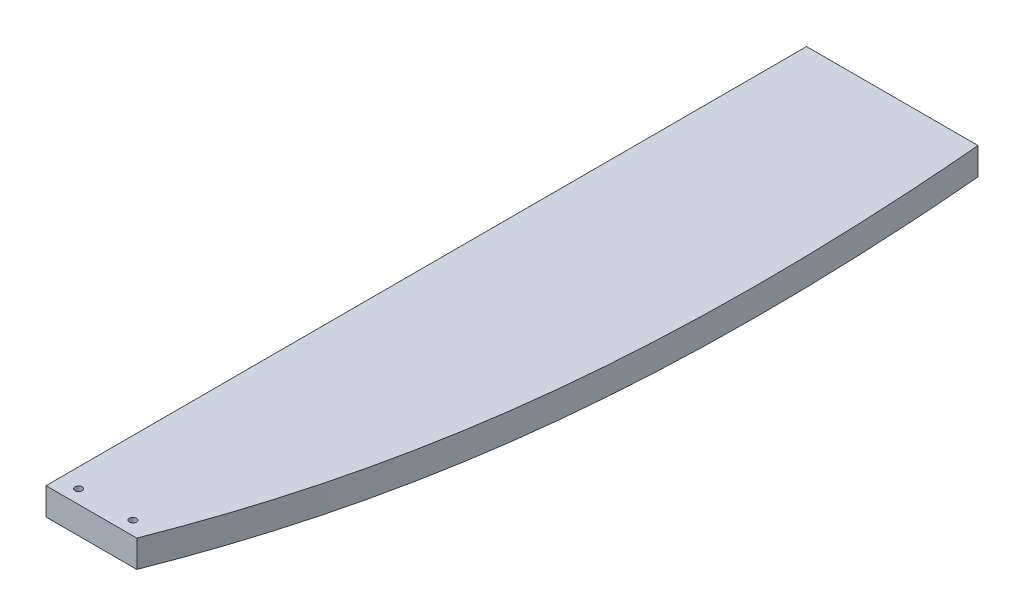
ISO-10303-21;
HEADER;
FILE_DESCRIPTION(('STEP AP214'),'2;1');
FILE_NAME('part.step','',(''),(''),'','','');
FILE_SCHEMA(('AUTOMOTIVE_DESIGN { 1 0 10303 214 1 1 1 1 }'));
ENDSEC;
DATA;
#1=APPLICATION_CONTEXT('core data for automotive mechanical design processes');
#2=APPLICATION_PROTOCOL_DEFINITION('international standard','automotive_design',2000,#1);
#3=PRODUCT_CONTEXT('',#1,'mechanical');
#4=PRODUCT('Part','Part','',(#3));
#5=PRODUCT_RELATED_PRODUCT_CATEGORY('part','',(#4));
#6=PRODUCT_DEFINITION_FORMATION('','',#4);
#7=PRODUCT_DEFINITION_CONTEXT('part definition',#1,'design');
#8=PRODUCT_DEFINITION('design','',#6,#7);
#9=PRODUCT_DEFINITION_SHAPE('','',#8);
#10=(LENGTH_UNIT() NAMED_UNIT(*) SI_UNIT(.MILLI.,.METRE.));
#11=(NAMED_UNIT(*) PLANE_ANGLE_UNIT() SI_UNIT($,.RADIAN.));
#12=(NAMED_UNIT(*) SI_UNIT($,.STERADIAN.) SOLID_ANGLE_UNIT());
#13=UNCERTAINTY_MEASURE_WITH_UNIT(LENGTH_MEASURE(1.E-05),#10,'distance_accuracy_value','');
#14=(GEOMETRIC_REPRESENTATION_CONTEXT(3) GLOBAL_UNCERTAINTY_ASSIGNED_CONTEXT((#13)) GLOBAL_UNIT_ASSIGNED_CONTEXT((#10,
#11,#12)) REPRESENTATION_CONTEXT('',''));
#15=CARTESIAN_POINT('',(0.,0.,0.));
#16=DIRECTION('',(0.,0.,1.));
#17=DIRECTION('',(1.,0.,0.));
#18=AXIS2_PLACEMENT_3D('',#15,#16,#17);
#19=CARTESIAN_POINT('',(389.5016067869,5194.3,2950.05622050594));
#20=DIRECTION('',(0.,1.,0.));
#21=DIRECTION('',(-1.,0.,0.));
#22=AXIS2_PLACEMENT_3D('',#19,#20,#21);
#23=PLANE('',#22);
#24=CARTESIAN_POINT('',(376.528681754766,5194.30000000001,3207.07744091049));
#25=DIRECTION('',(0.,1.,0.));
#26=DIRECTION('',(-1.,0.,0.));
#27=AXIS2_PLACEMENT_3D('',#24,#25,#26);
#28=CIRCLE('',#27,2.45744999999997);
#29=CARTESIAN_POINT('',(374.071231754766,5194.30000000001,3207.07744091049));
#30=VERTEX_POINT('',#29);
#31=EDGE_CURVE('E310',#30,#30,#28,.T.);
#32=ORIENTED_EDGE('',*,*,#31,.T.);
#33=EDGE_LOOP('',(#32));
#34=FACE_BOUND('',#33,.T.);
#35=CARTESIAN_POINT('',(338.428578956983,5194.3,3207.07744091058));
#36=DIRECTION('',(0.,1.,0.));
#37=DIRECTION('',(-1.,0.,0.));
#38=AXIS2_PLACEMENT_3D('',#35,#36,#37);
#39=CIRCLE('',#38,2.45744999999997);
#40=CARTESIAN_POINT('',(335.971128956983,5194.3,3207.07744091058));
#41=VERTEX_POINT('',#40);
#42=EDGE_CURVE('E136',#41,#41,#39,.T.);
#43=ORIENTED_EDGE('',*,*,#42,.T.);
#44=EDGE_LOOP('',(#43));
#45=FACE_BOUND('',#44,.T.);
#46=DIRECTION('',(-1.,0.,0.));
#47=VECTOR('',#46,1.);
#48=CARTESIAN_POINT('',(445.271141729743,5194.3,2683.51));
#49=LINE('',#48,#47);
#50=CARTESIAN_POINT('',(445.271141729743,5194.3,2683.51));
#51=VERTEX_POINT('',#50);
#52=CARTESIAN_POINT('',(325.120000000001,5194.3,2683.51));
#53=VERTEX_POINT('',#52);
#54=EDGE_CURVE('E178',#51,#53,#49,.T.);
#55=ORIENTED_EDGE('',*,*,#54,.F.);
#56=CARTESIAN_POINT('',(388.748833209512,5194.3,3216.60244101189));
#57=CARTESIAN_POINT('',(389.522252968135,5194.30000000001,3214.63182176014));
#58=CARTESIAN_POINT('',(390.288721724351,5194.30000000001,3212.65847358438));
#59=CARTESIAN_POINT('',(391.807587176833,5194.30000000001,3208.70646110342));
#60=CARTESIAN_POINT('',(392.559984442725,5194.30000000001,3206.72779701715));
#61=CARTESIAN_POINT('',(394.050584006539,5194.30000000001,3202.7651760804));
#62=CARTESIAN_POINT('',(394.788786601799,5194.30000000001,3200.78121934178));
#63=CARTESIAN_POINT('',(396.251182478673,5194.30000000001,3196.8072370958));
#64=CARTESIAN_POINT('',(396.975369962836,5194.30000000001,3194.81720945522));
#65=CARTESIAN_POINT('',(398.409326379546,5194.30000000001,3190.8319153354));
#66=CARTESIAN_POINT('',(399.119095003552,5194.30000000001,3188.83664874507));
#67=CARTESIAN_POINT('',(400.524120705958,5194.30000000001,3184.84092335103));
#68=CARTESIAN_POINT('',(401.219377144054,5194.3,3182.84046432257));
#69=CARTESIAN_POINT('',(403.979981150923,5194.3,3174.80275179745));
#70=CARTESIAN_POINT('',(405.986229361712,5194.30000000001,3168.7450562538));
#71=CARTESIAN_POINT('',(409.864016063093,5194.30000000001,3156.58584521959));
#72=CARTESIAN_POINT('',(411.735535675616,5194.30000000001,3150.48432371939));
#73=CARTESIAN_POINT('',(415.342670234218,5194.30000000001,3138.24071743662));
#74=CARTESIAN_POINT('',(417.07827486598,5194.30000000001,3132.09862961383));
#75=CARTESIAN_POINT('',(420.413307310402,5194.30000000001,3119.77755039309));
#76=CARTESIAN_POINT('',(422.012733917512,5194.30000000001,3113.59855866895));
#77=CARTESIAN_POINT('',(425.076507654873,5194.30000000001,3101.20582036093));
#78=CARTESIAN_POINT('',(426.540826480793,5194.30000000001,3094.99206678251));
#79=CARTESIAN_POINT('',(429.335602965529,5194.30000000001,3082.53477442042));
#80=CARTESIAN_POINT('',(430.66606528599,5194.30000000001,3076.29123668194));
#81=CARTESIAN_POINT('',(433.195551254199,5194.30000000001,3063.77787947901));
#82=CARTESIAN_POINT('',(434.394580050257,5194.30000000001,3057.50806105398));
#83=CARTESIAN_POINT('',(436.664262798693,5194.30000000001,3044.94572418597));
#84=CARTESIAN_POINT('',(437.734926596352,5194.3,3038.65320752207));
#85=CARTESIAN_POINT('',(439.412841289308,5194.3,3028.16585891989));
#86=CARTESIAN_POINT('',(440.054930598952,5194.30000000001,3023.97656044392));
#87=CARTESIAN_POINT('',(441.285326649013,5194.30000000001,3015.59028760335));
#88=CARTESIAN_POINT('',(441.873636207082,5194.30000000001,3011.39331365267));
#89=CARTESIAN_POINT('',(442.997751229944,5194.30000000001,3002.99243079538));
#90=CARTESIAN_POINT('',(443.533557687156,5194.30000000001,2998.7885220214));
#91=CARTESIAN_POINT('',(444.553830346815,5194.30000000001,2990.37588429152));
#92=CARTESIAN_POINT('',(445.038313336258,5194.30000000001,2986.16715736967));
#93=CARTESIAN_POINT('',(445.957511897611,5194.30000000001,2977.74420167879));
#94=CARTESIAN_POINT('',(446.39222661266,5194.30000000001,2973.5299728163));
#95=CARTESIAN_POINT('',(447.213286250907,5194.30000000001,2965.0967391719));
#96=CARTESIAN_POINT('',(447.599630208292,5194.3,2960.87773429633));
#97=CARTESIAN_POINT('',(448.610399554395,5194.3,2949.12002029531));
#98=CARTESIAN_POINT('',(449.183460079724,5194.30000000001,2941.57684955928));
#99=CARTESIAN_POINT('',(450.188110587309,5194.30000000001,2926.48082596249));
#100=CARTESIAN_POINT('',(450.619694361841,5194.30000000001,2918.92797269146));
#101=CARTESIAN_POINT('',(451.167099565233,5194.30000000001,2907.5939338846));
#102=CARTESIAN_POINT('',(451.332907313246,5194.30000000001,2903.81509221511));
#103=CARTESIAN_POINT('',(451.63220063042,5194.30000000001,2896.2561191346));
#104=CARTESIAN_POINT('',(451.765686187029,5194.30000000001,2892.47598772308));
#105=CARTESIAN_POINT('',(452.001447257516,5194.30000000001,2884.91259385326));
#106=CARTESIAN_POINT('',(452.103704889073,5194.30000000001,2881.12933084029));
#107=CARTESIAN_POINT('',(452.277368935587,5194.30000000001,2873.56209999784));
#108=CARTESIAN_POINT('',(452.34877536084,5194.30000000001,2869.77813216859));
#109=CARTESIAN_POINT('',(452.462007398327,5194.30000000001,2862.20982426264));
#110=CARTESIAN_POINT('',(452.503833548247,5194.30000000001,2858.42548419396));
#111=CARTESIAN_POINT('',(452.558952189986,5194.30000000001,2850.8566043691));
#112=CARTESIAN_POINT('',(452.572244665884,5194.30000000001,2847.07206461283));
#113=CARTESIAN_POINT('',(452.570825815498,5194.30000000001,2835.71848246225));
#114=CARTESIAN_POINT('',(452.514819254081,5194.3,2828.14940488104));
#115=CARTESIAN_POINT('',(452.325706518358,5194.3,2814.8576360439));
#116=CARTESIAN_POINT('',(452.214721414391,5194.30000000001,2809.13460593405));
#117=CARTESIAN_POINT('',(451.936070151198,5194.30000000001,2797.68993762865));
#118=CARTESIAN_POINT('',(451.768404183398,5194.30000000001,2791.96829942846));
#119=CARTESIAN_POINT('',(451.378470854026,5194.30000000001,2780.52685123598));
#120=CARTESIAN_POINT('',(451.156203086376,5194.30000000001,2774.80704125759));
#121=CARTESIAN_POINT('',(450.658785505363,5194.30000000001,2763.36967450208));
#122=CARTESIAN_POINT('',(450.383635226402,5194.30000000001,2757.65211774522));
#123=CARTESIAN_POINT('',(449.782227506016,5194.30000000001,2746.22711571753));
#124=CARTESIAN_POINT('',(449.456036663212,5194.30000000001,2740.51966693659));
#125=CARTESIAN_POINT('',(448.753336873391,5194.30000000001,2729.10791697049));
#126=CARTESIAN_POINT('',(448.376828318642,5194.30000000001,2723.40361576115));
#127=CARTESIAN_POINT('',(447.57420189739,5194.30000000001,2711.99864715379));
#128=CARTESIAN_POINT('',(447.148085321016,5194.30000000001,2706.29797966515));
#129=CARTESIAN_POINT('',(446.471952170237,5194.30000000001,2697.75005038914));
#130=CARTESIAN_POINT('',(446.240420243813,5194.30000000001,2694.9013153148));
#131=CARTESIAN_POINT('',(445.765028486666,5194.30000000001,2689.20487423171));
#132=CARTESIAN_POINT('',(445.52116865699,5194.3,2686.35716822288));
#133=CARTESIAN_POINT('',(445.271141729745,5194.3,2683.51));
#134=B_SPLINE_CURVE_WITH_KNOTS('',3,(#56,#57,#58,#59,#60,#61,#62,#63,#64,#65,#66,#67,#68,#69,
#70,#71,#72,#73,#74,#75,#76,#77,#78,#79,#80,#81,#82,#83,#84,#85,#86,#87,#88,#89,#90,#91,#92,#93,
#94,#95,#96,#97,#98,#99,#100,#101,#102,#103,#104,#105,#106,#107,#108,#109,#110,#111,#112,#113,
#114,#115,#116,#117,#118,#119,#120,#121,#122,#123,#124,#125,#126,#127,#128,#129,#130,#131,#132,
#133),.UNSPECIFIED.,.F.,.F.,(4,2,2,2,2,2,2,2,2,2,2,2,2,2,2,2,2,2,2,2,2,2,2,2,2,2,2,2,2,2,2,2,2,
2,2,2,2,2,4),(0.,6.3508670135695,12.7014763794555,19.0519525736826,25.4050018387989,
31.7581869055696,38.1116516963101,57.2537350240531,76.3984953265155,95.5447070815522,
114.691088315576,133.841471545987,152.99118762006,172.140153323164,191.287649407017,
204.001986076296,216.715656228674,229.429086019741,242.13834455025,254.847821863679,
267.557552904961,290.250765480576,312.944973656978,324.292291318836,335.639613387369,
346.993421240415,358.347225304225,369.700822982526,381.05442699613,403.761418106076,
420.933479573432,438.105483047311,455.277614235264,472.449896620545,489.599956338763,
506.7498823654,523.899362482219,532.473724957064,541.048086704672),.UNSPECIFIED.);
#135=CARTESIAN_POINT('',(388.748833209511,5194.30000000001,3216.60244101189));
#136=VERTEX_POINT('',#135);
#137=EDGE_CURVE('E86',#136,#51,#134,.T.);
#138=ORIENTED_EDGE('',*,*,#137,.F.);
#139=DIRECTION('',(1.,0.,0.));
#140=VECTOR('',#139,1.);
#141=CARTESIAN_POINT('',(325.120000000002,5194.3,3216.60244101189));
#142=LINE('',#141,#140);
#143=CARTESIAN_POINT('',(325.120000000002,5194.3,3216.60244101189));
#144=VERTEX_POINT('',#143);
#145=EDGE_CURVE('E92',#144,#136,#142,.T.);
#146=ORIENTED_EDGE('',*,*,#145,.F.);
#147=DIRECTION('',(0.,0.,1.));
#148=VECTOR('',#147,1.);
#149=CARTESIAN_POINT('',(325.120000000001,5194.3,2683.51));
#150=LINE('',#149,#148);
#151=EDGE_CURVE('E100',#53,#144,#150,.T.);
#152=ORIENTED_EDGE('',*,*,#151,.F.);
#153=EDGE_LOOP('',(#55,#138,#146,#152));
#154=FACE_BOUND('',#153,.T.);
#155=ADVANCED_FACE('F52',(#34,#45,#154),#23,.F.);
#156=CARTESIAN_POINT('',(325.120000000001,5194.3,2683.51));
#157=DIRECTION('',(-1.,0.,0.));
#158=DIRECTION('',(0.,-1.,0.));
#159=AXIS2_PLACEMENT_3D('',#156,#157,#158);
#160=PLANE('',#159);
#161=CARTESIAN_POINT('',(325.12,5203.82500000001,2785.11));
#162=DIRECTION('',(-1.,0.,0.));
#163=DIRECTION('',(0.,-1.,0.));
#164=AXIS2_PLACEMENT_3D('',#161,#162,#163);
#165=CIRCLE('',#164,0.991870000000006);
#166=CARTESIAN_POINT('',(325.12,5202.83313000001,2785.11));
#167=VERTEX_POINT('',#166);
#168=EDGE_CURVE('E59',#167,#167,#165,.T.);
#169=ORIENTED_EDGE('',*,*,#168,.F.);
#170=EDGE_LOOP('',(#169));
#171=FACE_BOUND('',#170,.T.);
#172=CARTESIAN_POINT('',(325.12,5203.825,2886.71));
#173=DIRECTION('',(-1.,0.,0.));
#174=DIRECTION('',(0.,-1.,0.));
#175=AXIS2_PLACEMENT_3D('',#172,#173,#174);
#176=CIRCLE('',#175,0.991870000000006);
#177=CARTESIAN_POINT('',(325.12,5202.83313,2886.71));
#178=VERTEX_POINT('',#177);
#179=EDGE_CURVE('E147',#178,#178,#176,.T.);
#180=ORIENTED_EDGE('',*,*,#179,.F.);
#181=EDGE_LOOP('',(#180));
#182=FACE_BOUND('',#181,.T.);
#183=CARTESIAN_POINT('',(325.12,5203.825,2988.31));
#184=DIRECTION('',(-1.,0.,0.));
#185=DIRECTION('',(0.,-1.,0.));
#186=AXIS2_PLACEMENT_3D('',#183,#184,#185);
#187=CIRCLE('',#186,0.991870000000006);
#188=CARTESIAN_POINT('',(325.12,5202.83313,2988.31));
#189=VERTEX_POINT('',#188);
#190=EDGE_CURVE('E151',#189,#189,#187,.T.);
#191=ORIENTED_EDGE('',*,*,#190,.F.);
#192=EDGE_LOOP('',(#191));
#193=FACE_BOUND('',#192,.T.);
#194=CARTESIAN_POINT('',(325.12,5203.82500000001,3089.91));
#195=DIRECTION('',(-1.,0.,0.));
#196=DIRECTION('',(0.,-1.,0.));
#197=AXIS2_PLACEMENT_3D('',#194,#195,#196);
#198=CIRCLE('',#197,0.991870000000006);
#199=CARTESIAN_POINT('',(325.12,5202.83313000001,3089.91));
#200=VERTEX_POINT('',#199);
#201=EDGE_CURVE('E155',#200,#200,#198,.T.);
#202=ORIENTED_EDGE('',*,*,#201,.F.);
#203=EDGE_LOOP('',(#202));
#204=FACE_BOUND('',#203,.T.);
#205=CARTESIAN_POINT('',(325.12,5203.825,3191.51));
#206=DIRECTION('',(-1.,0.,0.));
#207=DIRECTION('',(0.,-1.,0.));
#208=AXIS2_PLACEMENT_3D('',#205,#206,#207);
#209=CIRCLE('',#208,0.991870000000006);
#210=CARTESIAN_POINT('',(325.12,5202.83313,3191.51));
#211=VERTEX_POINT('',#210);
#212=EDGE_CURVE('E159',#211,#211,#209,.T.);
#213=ORIENTED_EDGE('',*,*,#212,.F.);
#214=EDGE_LOOP('',(#213));
#215=FACE_BOUND('',#214,.T.);
#216=DIRECTION('',(0.,0.,1.));
#217=VECTOR('',#216,1.);
#218=CARTESIAN_POINT('',(325.120000000001,5213.35,2950.05622050594));
#219=LINE('',#218,#217);
#220=CARTESIAN_POINT('',(325.12,5213.35,2683.51));
#221=VERTEX_POINT('',#220);
#222=CARTESIAN_POINT('',(325.12,5213.35,3216.6024410119));
#223=VERTEX_POINT('',#222);
#224=EDGE_CURVE('E106',#221,#223,#219,.T.);
#225=ORIENTED_EDGE('',*,*,#224,.F.);
#226=DIRECTION('',(0.,1.,0.));
#227=VECTOR('',#226,1.);
#228=CARTESIAN_POINT('',(325.120000000001,5194.3,2683.51));
#229=LINE('',#228,#227);
#230=EDGE_CURVE('E176',#53,#221,#229,.T.);
#231=ORIENTED_EDGE('',*,*,#230,.F.);
#232=ORIENTED_EDGE('',*,*,#151,.T.);
#233=DIRECTION('',(0.,1.,0.));
#234=VECTOR('',#233,1.);
#235=CARTESIAN_POINT('',(325.120000000002,5194.3,3216.60244101189));
#236=LINE('',#235,#234);
#237=EDGE_CURVE('E187',#223,#144,#236,.F.);
#238=ORIENTED_EDGE('',*,*,#237,.F.);
#239=EDGE_LOOP('',(#225,#231,#232,#238));
#240=FACE_BOUND('',#239,.T.);
#241=ADVANCED_FACE('F229',(#171,#182,#193,#204,#215,#240),#160,.T.);
#242=CARTESIAN_POINT('',(325.120000000002,5194.3,3216.60244101189));
#243=DIRECTION('',(0.,0.,1.));
#244=DIRECTION('',(1.,0.,0.));
#245=AXIS2_PLACEMENT_3D('',#242,#243,#244);
#246=PLANE('',#245);
#247=DIRECTION('',(-1.,0.,0.));
#248=VECTOR('',#247,1.);
#249=CARTESIAN_POINT('',(389.501606786901,5213.35000000001,3216.60244101189));
#250=LINE('',#249,#248);
#251=CARTESIAN_POINT('',(388.748833209509,5213.35,3216.60244101189));
#252=VERTEX_POINT('',#251);
#253=EDGE_CURVE('E170',#223,#252,#250,.F.);
#254=ORIENTED_EDGE('',*,*,#253,.F.);
#255=ORIENTED_EDGE('',*,*,#237,.T.);
#256=ORIENTED_EDGE('',*,*,#145,.T.);
#257=DIRECTION('',(1.36890498936282E-13,-1.,0.));
#258=VECTOR('',#257,1.);
#259=CARTESIAN_POINT('',(388.74883320951,5203.825,3216.6024410119));
#260=LINE('',#259,#258);
#261=EDGE_CURVE('E184',#252,#136,#260,.T.);
#262=ORIENTED_EDGE('',*,*,#261,.F.);
#263=EDGE_LOOP('',(#254,#255,#256,#262));
#264=FACE_BOUND('',#263,.T.);
#265=ADVANCED_FACE('F226',(#264),#246,.T.);
#266=CARTESIAN_POINT('',(388.748833209512,5194.3,3216.60244101189));
#267=CARTESIAN_POINT('',(388.748833209509,5213.35,3216.60244101189));
#268=CARTESIAN_POINT('',(427.328274562891,5194.30000000001,3118.30445867765));
#269=CARTESIAN_POINT('',(427.328274562891,5213.35000000001,3118.30445867765));
#270=CARTESIAN_POINT('',(448.538626648827,5194.3,3013.430965814));
#271=CARTESIAN_POINT('',(448.538626648827,5213.35000000001,3013.430965814));
#272=CARTESIAN_POINT('',(453.875260666032,5194.30000000001,2815.15896694759));
#273=CARTESIAN_POINT('',(453.875260666028,5213.35,2815.15896694759));
#274=CARTESIAN_POINT('',(450.72161494878,5194.3,2745.57602142326));
#275=CARTESIAN_POINT('',(450.721614948777,5213.35,2745.57602142326));
#276=CARTESIAN_POINT('',(445.271141729743,5194.3,2683.51));
#277=CARTESIAN_POINT('',(445.271141729743,5213.35000000001,2683.51));
#278=B_SPLINE_SURFACE_WITH_KNOTS('',3,1,((#266,#267),(#268,#269),(#270,#271),(#272,#273),(#274,
#275),(#276,#277)),.UNSPECIFIED.,.F.,.F.,.F.,(4,2,4),(2,2),(-53.1349686655124,-24.0856941468216,
-9.03456928373366),(0.,1.90499999999997),.UNSPECIFIED.);
#279=CARTESIAN_POINT('',(388.748833209509,5213.35,3216.60244101189));
#280=CARTESIAN_POINT('',(389.522252968131,5213.35000000001,3214.63182176014));
#281=CARTESIAN_POINT('',(390.288721724348,5213.35000000001,3212.65847358438));
#282=CARTESIAN_POINT('',(391.80758717683,5213.35000000001,3208.70646110342));
#283=CARTESIAN_POINT('',(392.559984442722,5213.35000000001,3206.72779701715));
#284=CARTESIAN_POINT('',(394.050584006537,5213.35000000001,3202.7651760804));
#285=CARTESIAN_POINT('',(394.788786601796,5213.35000000001,3200.78121934178));
#286=CARTESIAN_POINT('',(396.251182478669,5213.35000000001,3196.80723709581));
#287=CARTESIAN_POINT('',(396.975369962834,5213.35000000001,3194.81720945522));
#288=CARTESIAN_POINT('',(398.409326379543,5213.35000000001,3190.8319153354));
#289=CARTESIAN_POINT('',(399.119095003549,5213.35000000001,3188.83664874507));
#290=CARTESIAN_POINT('',(400.524120705956,5213.35000000001,3184.84092335103));
#291=CARTESIAN_POINT('',(401.219377144053,5213.35,3182.84046432257));
#292=CARTESIAN_POINT('',(403.979981150924,5213.35,3174.80275179745));
#293=CARTESIAN_POINT('',(405.986229361711,5213.35000000001,3168.7450562538));
#294=CARTESIAN_POINT('',(409.864016063091,5213.35000000001,3156.58584521959));
#295=CARTESIAN_POINT('',(411.735535675614,5213.35000000001,3150.48432371939));
#296=CARTESIAN_POINT('',(415.342670234216,5213.35000000001,3138.24071743662));
#297=CARTESIAN_POINT('',(417.078274865978,5213.35000000001,3132.09862961383));
#298=CARTESIAN_POINT('',(420.413307310401,5213.35000000001,3119.77755039309));
#299=CARTESIAN_POINT('',(422.012733917511,5213.35000000001,3113.59855866895));
#300=CARTESIAN_POINT('',(425.076507654872,5213.35000000001,3101.20582036093));
#301=CARTESIAN_POINT('',(426.540826480792,5213.35000000001,3094.99206678251));
#302=CARTESIAN_POINT('',(429.335602965528,5213.35000000001,3082.53477442042));
#303=CARTESIAN_POINT('',(430.666065285989,5213.35000000001,3076.29123668194));
#304=CARTESIAN_POINT('',(433.195551254199,5213.35000000001,3063.77787947901));
#305=CARTESIAN_POINT('',(434.394580050256,5213.35000000001,3057.50806105398));
#306=CARTESIAN_POINT('',(436.664262798693,5213.35000000001,3044.94572418597));
#307=CARTESIAN_POINT('',(437.734926596351,5213.35,3038.65320752207));
#308=CARTESIAN_POINT('',(439.412841289307,5213.35,3028.16585891989));
#309=CARTESIAN_POINT('',(440.054930598951,5213.35000000001,3023.97656044392));
#310=CARTESIAN_POINT('',(441.285326649012,5213.35000000001,3015.59028760335));
#311=CARTESIAN_POINT('',(441.87363620708,5213.35000000001,3011.39331365267));
#312=CARTESIAN_POINT('',(442.997751229943,5213.35000000001,3002.99243079538));
#313=CARTESIAN_POINT('',(443.533557687155,5213.35000000001,2998.7885220214));
#314=CARTESIAN_POINT('',(444.553830346814,5213.35000000001,2990.37588429152));
#315=CARTESIAN_POINT('',(445.038313336256,5213.35000000001,2986.16715736967));
#316=CARTESIAN_POINT('',(445.95751189761,5213.35000000001,2977.7442016788));
#317=CARTESIAN_POINT('',(446.392226612659,5213.35000000001,2973.5299728163));
#318=CARTESIAN_POINT('',(447.213286250906,5213.35000000001,2965.0967391719));
#319=CARTESIAN_POINT('',(447.599630208291,5213.35000000001,2960.87773429634));
#320=CARTESIAN_POINT('',(448.610399554394,5213.35,2949.12002029531));
#321=CARTESIAN_POINT('',(449.183460079722,5213.35000000001,2941.57684955929));
#322=CARTESIAN_POINT('',(450.188110587307,5213.35000000001,2926.48082596249));
#323=CARTESIAN_POINT('',(450.619694361839,5213.35000000001,2918.92797269146));
#324=CARTESIAN_POINT('',(451.167099565231,5213.35000000001,2907.5939338846));
#325=CARTESIAN_POINT('',(451.332907313243,5213.35000000001,2903.81509221511));
#326=CARTESIAN_POINT('',(451.632200630417,5213.35000000001,2896.2561191346));
#327=CARTESIAN_POINT('',(451.765686187027,5213.35000000001,2892.47598772308));
#328=CARTESIAN_POINT('',(452.001447257514,5213.35000000001,2884.91259385326));
#329=CARTESIAN_POINT('',(452.10370488907,5213.35000000001,2881.12933084029));
#330=CARTESIAN_POINT('',(452.277368935584,5213.35000000001,2873.56209999784));
#331=CARTESIAN_POINT('',(452.348775360837,5213.35000000001,2869.77813216859));
#332=CARTESIAN_POINT('',(452.462007398324,5213.35000000001,2862.20982426264));
#333=CARTESIAN_POINT('',(452.503833548244,5213.35000000001,2858.42548419396));
#334=CARTESIAN_POINT('',(452.558952189983,5213.35000000001,2850.85660436911));
#335=CARTESIAN_POINT('',(452.572244665881,5213.35000000001,2847.07206461283));
#336=CARTESIAN_POINT('',(452.570825815495,5213.35000000001,2835.71848246225));
#337=CARTESIAN_POINT('',(452.514819254078,5213.35,2828.14940488104));
#338=CARTESIAN_POINT('',(452.325706518355,5213.35,2814.8576360439));
#339=CARTESIAN_POINT('',(452.214721414388,5213.35000000001,2809.13460593405));
#340=CARTESIAN_POINT('',(451.936070151195,5213.35000000001,2797.68993762865));
#341=CARTESIAN_POINT('',(451.768404183395,5213.35000000001,2791.96829942846));
#342=CARTESIAN_POINT('',(451.378470854023,5213.35000000001,2780.52685123598));
#343=CARTESIAN_POINT('',(451.156203086373,5213.35000000001,2774.80704125759));
#344=CARTESIAN_POINT('',(450.65878550536,5213.35000000001,2763.36967450208));
#345=CARTESIAN_POINT('',(450.383635226399,5213.35000000001,2757.65211774522));
#346=CARTESIAN_POINT('',(449.782227506013,5213.35000000001,2746.22711571754));
#347=CARTESIAN_POINT('',(449.456036663209,5213.35000000001,2740.51966693659));
#348=CARTESIAN_POINT('',(448.753336873388,5213.35000000001,2729.10791697049));
#349=CARTESIAN_POINT('',(448.37682831864,5213.35000000001,2723.40361576115));
#350=CARTESIAN_POINT('',(447.574201897388,5213.35000000001,2711.99864715379));
#351=CARTESIAN_POINT('',(447.148085321015,5213.35000000001,2706.29797966515));
#352=CARTESIAN_POINT('',(446.471952170236,5213.35000000001,2697.75005038914));
#353=CARTESIAN_POINT('',(446.240420243812,5213.35000000001,2694.9013153148));
#354=CARTESIAN_POINT('',(445.765028486665,5213.35000000001,2689.20487423171));
#355=CARTESIAN_POINT('',(445.521168656988,5213.35000000001,2686.35716822288));
#356=CARTESIAN_POINT('',(445.271141729743,5213.35,2683.51));
#357=B_SPLINE_CURVE_WITH_KNOTS('',3,(#279,#280,#281,#282,#283,#284,#285,#286,#287,#288,#289,
#290,#291,#292,#293,#294,#295,#296,#297,#298,#299,#300,#301,#302,#303,#304,#305,#306,#307,#308,
#309,#310,#311,#312,#313,#314,#315,#316,#317,#318,#319,#320,#321,#322,#323,#324,#325,#326,#327,
#328,#329,#330,#331,#332,#333,#334,#335,#336,#337,#338,#339,#340,#341,#342,#343,#344,#345,#346,
#347,#348,#349,#350,#351,#352,#353,#354,#355,#356),.UNSPECIFIED.,.F.,.F.,(4,2,2,2,2,2,2,2,2,2,2,
2,2,2,2,2,2,2,2,2,2,2,2,2,2,2,2,2,2,2,2,2,2,2,2,2,2,2,4),(0.,6.35086701356911,12.7014763794556,
19.0519525736827,25.4050018387991,31.7581869055703,38.1116516963113,57.2537350240541,
76.398495326516,95.5447070815528,114.691088315577,133.841471545988,152.991187620062,
172.140153323166,191.287649407018,204.001986076297,216.715656228675,229.429086019741,
242.138344550251,254.847821863679,267.55755290496,290.250765480575,312.944973656978,
324.292291318835,335.639613387369,346.993421240414,358.347225304225,369.700822982527,
381.054426996129,403.761418106076,420.933479573433,438.105483047311,455.277614235264,
472.449896620545,489.599956338764,506.7498823654,523.899362482219,532.473724957065,
541.048086704672),.UNSPECIFIED.);
#358=CARTESIAN_POINT('',(445.271141729744,5213.35000000001,2683.51));
#359=VERTEX_POINT('',#358);
#360=EDGE_CURVE('E65',#252,#359,#357,.T.);
#361=DIRECTION('',(0.,1.,0.));
#362=VECTOR('',#361,1.);
#363=CARTESIAN_POINT('',(445.271141729743,5194.3,2683.51));
#364=LINE('',#363,#362);
#365=EDGE_CURVE('E74',#359,#51,#364,.F.);
#366=ORIENTED_EDGE('',*,*,#360,.F.);
#367=ORIENTED_EDGE('',*,*,#261,.T.);
#368=ORIENTED_EDGE('',*,*,#137,.T.);
#369=ORIENTED_EDGE('',*,*,#365,.F.);
#370=EDGE_LOOP('',(#366,#367,#368,#369));
#371=FACE_BOUND('',#370,.T.);
#372=ADVANCED_FACE('F54',(#371),#278,.T.);
#373=CARTESIAN_POINT('',(445.271141729743,5194.3,2683.51));
#374=DIRECTION('',(0.,0.,-1.));
#375=DIRECTION('',(-1.,0.,0.));
#376=AXIS2_PLACEMENT_3D('',#373,#374,#375);
#377=PLANE('',#376);
#378=CARTESIAN_POINT('',(414.990074060502,5203.825,2683.51));
#379=DIRECTION('',(0.,0.,-1.));
#380=DIRECTION('',(-1.,0.,0.));
#381=AXIS2_PLACEMENT_3D('',#378,#379,#380);
#382=CIRCLE('',#381,0.991870000000006);
#383=CARTESIAN_POINT('',(413.998204060502,5203.825,2683.51));
#384=VERTEX_POINT('',#383);
#385=EDGE_CURVE('E163',#384,#384,#382,.T.);
#386=ORIENTED_EDGE('',*,*,#385,.F.);
#387=EDGE_LOOP('',(#386));
#388=FACE_BOUND('',#387,.T.);
#389=CARTESIAN_POINT('',(355.076691353501,5203.825,2683.51));
#390=DIRECTION('',(0.,0.,-1.));
#391=DIRECTION('',(-1.,0.,0.));
#392=AXIS2_PLACEMENT_3D('',#389,#390,#391);
#393=CIRCLE('',#392,0.991870000000006);
#394=CARTESIAN_POINT('',(354.084821353501,5203.825,2683.51));
#395=VERTEX_POINT('',#394);
#396=EDGE_CURVE('E166',#395,#395,#393,.T.);
#397=ORIENTED_EDGE('',*,*,#396,.F.);
#398=EDGE_LOOP('',(#397));
#399=FACE_BOUND('',#398,.T.);
#400=DIRECTION('',(-1.,0.,0.));
#401=VECTOR('',#400,1.);
#402=CARTESIAN_POINT('',(389.501606786901,5213.35,2683.51));
#403=LINE('',#402,#401);
#404=EDGE_CURVE('E13',#359,#221,#403,.T.);
#405=ORIENTED_EDGE('',*,*,#404,.F.);
#406=ORIENTED_EDGE('',*,*,#365,.T.);
#407=ORIENTED_EDGE('',*,*,#54,.T.);
#408=ORIENTED_EDGE('',*,*,#230,.T.);
#409=EDGE_LOOP('',(#405,#406,#407,#408));
#410=FACE_BOUND('',#409,.T.);
#411=ADVANCED_FACE('F220',(#388,#399,#410),#377,.T.);
#412=CARTESIAN_POINT('',(389.501606786901,5213.35,2950.05622050594));
#413=DIRECTION('',(0.,1.,0.));
#414=DIRECTION('',(-1.,0.,0.));
#415=AXIS2_PLACEMENT_3D('',#412,#413,#414);
#416=PLANE('',#415);
#417=CARTESIAN_POINT('',(376.528681754766,5213.35000000001,3207.0774409105));
#418=DIRECTION('',(0.,1.,0.));
#419=DIRECTION('',(0.,0.,1.));
#420=AXIS2_PLACEMENT_3D('',#417,#418,#419);
#421=CIRCLE('',#420,2.45744999999997);
#422=CARTESIAN_POINT('',(376.528681754766,5213.35000000001,3209.5348909105));
#423=VERTEX_POINT('',#422);
#424=EDGE_CURVE('E308',#423,#423,#421,.T.);
#425=ORIENTED_EDGE('',*,*,#424,.F.);
#426=EDGE_LOOP('',(#425));
#427=FACE_BOUND('',#426,.T.);
#428=CARTESIAN_POINT('',(338.428578956983,5213.35,3207.07744091058));
#429=DIRECTION('',(0.,1.,0.));
#430=DIRECTION('',(0.,0.,1.));
#431=AXIS2_PLACEMENT_3D('',#428,#429,#430);
#432=CIRCLE('',#431,2.45744999999997);
#433=CARTESIAN_POINT('',(338.428578956983,5213.35,3209.53489091058));
#434=VERTEX_POINT('',#433);
#435=EDGE_CURVE('E141',#434,#434,#432,.T.);
#436=ORIENTED_EDGE('',*,*,#435,.F.);
#437=EDGE_LOOP('',(#436));
#438=FACE_BOUND('',#437,.T.);
#439=ORIENTED_EDGE('',*,*,#360,.T.);
#440=ORIENTED_EDGE('',*,*,#404,.T.);
#441=ORIENTED_EDGE('',*,*,#224,.T.);
#442=ORIENTED_EDGE('',*,*,#253,.T.);
#443=EDGE_LOOP('',(#439,#440,#441,#442));
#444=FACE_BOUND('',#443,.T.);
#445=ADVANCED_FACE('F214',(#427,#438,#444),#416,.T.);
#446=CARTESIAN_POINT('',(355.076691353501,5203.825,2702.56));
#447=DIRECTION('',(0.,0.,-1.));
#448=DIRECTION('',(-1.,0.,0.));
#449=AXIS2_PLACEMENT_3D('',#446,#447,#448);
#450=CONICAL_SURFACE('',#449,0.991870000000006,1.02974425867677);
#451=CARTESIAN_POINT('',(355.076691353501,5203.825,2703.1559756222));
#452=VERTEX_POINT('',#451);
#453=VERTEX_LOOP('',#452);
#454=FACE_BOUND('',#453,.T.);
#455=CARTESIAN_POINT('',(355.076691353501,5203.825,2702.56));
#456=DIRECTION('',(0.,0.,-1.));
#457=DIRECTION('',(-1.,0.,0.));
#458=AXIS2_PLACEMENT_3D('',#455,#456,#457);
#459=CIRCLE('',#458,0.991870000000006);
#460=CARTESIAN_POINT('',(354.084821353501,5203.825,2702.56));
#461=VERTEX_POINT('',#460);
#462=EDGE_CURVE('E164',#461,#461,#459,.T.);
#463=ORIENTED_EDGE('',*,*,#462,.T.);
#464=EDGE_LOOP('',(#463));
#465=FACE_BOUND('',#464,.T.);
#466=ADVANCED_FACE('F219',(#454,#465),#450,.F.);
#467=CARTESIAN_POINT('',(355.076691353501,5203.825,2664.46));
#468=DIRECTION('',(0.,0.,-1.));
#469=DIRECTION('',(-1.,0.,0.));
#470=AXIS2_PLACEMENT_3D('',#467,#468,#469);
#471=CYLINDRICAL_SURFACE('',#470,0.991870000000006);
#472=ORIENTED_EDGE('',*,*,#396,.T.);
#473=EDGE_LOOP('',(#472));
#474=FACE_BOUND('',#473,.T.);
#475=ORIENTED_EDGE('',*,*,#462,.F.);
#476=EDGE_LOOP('',(#475));
#477=FACE_BOUND('',#476,.T.);
#478=ADVANCED_FACE('F241',(#474,#477),#471,.F.);
#479=CARTESIAN_POINT('',(414.990074060502,5203.825,2702.56));
#480=DIRECTION('',(0.,0.,-1.));
#481=DIRECTION('',(-1.,0.,0.));
#482=AXIS2_PLACEMENT_3D('',#479,#480,#481);
#483=CONICAL_SURFACE('',#482,0.991870000000006,1.02974425867677);
#484=CARTESIAN_POINT('',(414.990074060502,5203.825,2703.1559756222));
#485=VERTEX_POINT('',#484);
#486=VERTEX_LOOP('',#485);
#487=FACE_BOUND('',#486,.T.);
#488=CARTESIAN_POINT('',(414.990074060502,5203.825,2702.56));
#489=DIRECTION('',(0.,0.,-1.));
#490=DIRECTION('',(-1.,0.,0.));
#491=AXIS2_PLACEMENT_3D('',#488,#489,#490);
#492=CIRCLE('',#491,0.991870000000006);
#493=CARTESIAN_POINT('',(413.998204060502,5203.825,2702.56));
#494=VERTEX_POINT('',#493);
#495=EDGE_CURVE('E160',#494,#494,#492,.T.);
#496=ORIENTED_EDGE('',*,*,#495,.T.);
#497=EDGE_LOOP('',(#496));
#498=FACE_BOUND('',#497,.T.);
#499=ADVANCED_FACE('F246',(#487,#498),#483,.F.);
#500=CARTESIAN_POINT('',(414.990074060502,5203.825,2664.46));
#501=DIRECTION('',(0.,0.,-1.));
#502=DIRECTION('',(-1.,0.,0.));
#503=AXIS2_PLACEMENT_3D('',#500,#501,#502);
#504=CYLINDRICAL_SURFACE('',#503,0.991870000000006);
#505=ORIENTED_EDGE('',*,*,#385,.T.);
#506=EDGE_LOOP('',(#505));
#507=FACE_BOUND('',#506,.T.);
#508=ORIENTED_EDGE('',*,*,#495,.F.);
#509=EDGE_LOOP('',(#508));
#510=FACE_BOUND('',#509,.T.);
#511=ADVANCED_FACE('F254',(#507,#510),#504,.F.);
#512=CARTESIAN_POINT('',(344.17,5203.825,3191.51));
#513=DIRECTION('',(-1.,0.,0.));
#514=DIRECTION('',(0.,0.,1.));
#515=AXIS2_PLACEMENT_3D('',#512,#513,#514);
#516=CONICAL_SURFACE('',#515,0.991870000000006,1.02974425867665);
#517=CARTESIAN_POINT('',(344.765975622195,5203.825,3191.51));
#518=VERTEX_POINT('',#517);
#519=VERTEX_LOOP('',#518);
#520=FACE_BOUND('',#519,.T.);
#521=CARTESIAN_POINT('',(344.17,5203.825,3191.51));
#522=DIRECTION('',(-1.,0.,0.));
#523=DIRECTION('',(0.,0.,1.));
#524=AXIS2_PLACEMENT_3D('',#521,#522,#523);
#525=CIRCLE('',#524,0.991870000000006);
#526=CARTESIAN_POINT('',(344.17,5203.825,3192.50187));
#527=VERTEX_POINT('',#526);
#528=EDGE_CURVE('E156',#527,#527,#525,.T.);
#529=ORIENTED_EDGE('',*,*,#528,.T.);
#530=EDGE_LOOP('',(#529));
#531=FACE_BOUND('',#530,.T.);
#532=ADVANCED_FACE('F261',(#520,#531),#516,.F.);
#533=CARTESIAN_POINT('',(312.42,5203.825,3191.51));
#534=DIRECTION('',(-1.,0.,0.));
#535=DIRECTION('',(0.,0.,1.));
#536=AXIS2_PLACEMENT_3D('',#533,#534,#535);
#537=CYLINDRICAL_SURFACE('',#536,0.991870000000006);
#538=ORIENTED_EDGE('',*,*,#212,.T.);
#539=EDGE_LOOP('',(#538));
#540=FACE_BOUND('',#539,.T.);
#541=ORIENTED_EDGE('',*,*,#528,.F.);
#542=EDGE_LOOP('',(#541));
#543=FACE_BOUND('',#542,.T.);
#544=ADVANCED_FACE('F265',(#540,#543),#537,.F.);
#545=CARTESIAN_POINT('',(344.170000000001,5203.82500000001,3089.91));
#546=DIRECTION('',(-1.,0.,0.));
#547=DIRECTION('',(0.,0.,1.));
#548=AXIS2_PLACEMENT_3D('',#545,#546,#547);
#549=CONICAL_SURFACE('',#548,0.991870000000006,1.02974425867665);
#550=CARTESIAN_POINT('',(344.765975622195,5203.82500000001,3089.91));
#551=VERTEX_POINT('',#550);
#552=VERTEX_LOOP('',#551);
#553=FACE_BOUND('',#552,.T.);
#554=CARTESIAN_POINT('',(344.170000000001,5203.82500000001,3089.91));
#555=DIRECTION('',(-1.,0.,0.));
#556=DIRECTION('',(0.,0.,1.));
#557=AXIS2_PLACEMENT_3D('',#554,#555,#556);
#558=CIRCLE('',#557,0.991870000000006);
#559=CARTESIAN_POINT('',(344.170000000001,5203.82500000001,3090.90187));
#560=VERTEX_POINT('',#559);
#561=EDGE_CURVE('E152',#560,#560,#558,.T.);
#562=ORIENTED_EDGE('',*,*,#561,.T.);
#563=EDGE_LOOP('',(#562));
#564=FACE_BOUND('',#563,.T.);
#565=ADVANCED_FACE('F269',(#553,#564),#549,.F.);
#566=CARTESIAN_POINT('',(312.420000000001,5203.825,3089.91));
#567=DIRECTION('',(-1.,0.,0.));
#568=DIRECTION('',(0.,0.,1.));
#569=AXIS2_PLACEMENT_3D('',#566,#567,#568);
#570=CYLINDRICAL_SURFACE('',#569,0.991870000000006);
#571=ORIENTED_EDGE('',*,*,#201,.T.);
#572=EDGE_LOOP('',(#571));
#573=FACE_BOUND('',#572,.T.);
#574=ORIENTED_EDGE('',*,*,#561,.F.);
#575=EDGE_LOOP('',(#574));
#576=FACE_BOUND('',#575,.T.);
#577=ADVANCED_FACE('F273',(#573,#576),#570,.F.);
#578=CARTESIAN_POINT('',(344.17,5203.825,2988.31));
#579=DIRECTION('',(-1.,0.,0.));
#580=DIRECTION('',(0.,0.,1.));
#581=AXIS2_PLACEMENT_3D('',#578,#579,#580);
#582=CONICAL_SURFACE('',#581,0.991870000000006,1.02974425867665);
#583=CARTESIAN_POINT('',(344.765975622195,5203.825,2988.31));
#584=VERTEX_POINT('',#583);
#585=VERTEX_LOOP('',#584);
#586=FACE_BOUND('',#585,.T.);
#587=CARTESIAN_POINT('',(344.17,5203.825,2988.31));
#588=DIRECTION('',(-1.,0.,0.));
#589=DIRECTION('',(0.,0.,1.));
#590=AXIS2_PLACEMENT_3D('',#587,#588,#589);
#591=CIRCLE('',#590,0.991870000000006);
#592=CARTESIAN_POINT('',(344.17,5203.825,2989.30187));
#593=VERTEX_POINT('',#592);
#594=EDGE_CURVE('E148',#593,#593,#591,.T.);
#595=ORIENTED_EDGE('',*,*,#594,.T.);
#596=EDGE_LOOP('',(#595));
#597=FACE_BOUND('',#596,.T.);
#598=ADVANCED_FACE('F277',(#586,#597),#582,.F.);
#599=CARTESIAN_POINT('',(312.42,5203.825,2988.31));
#600=DIRECTION('',(-1.,0.,0.));
#601=DIRECTION('',(0.,0.,1.));
#602=AXIS2_PLACEMENT_3D('',#599,#600,#601);
#603=CYLINDRICAL_SURFACE('',#602,0.991870000000006);
#604=ORIENTED_EDGE('',*,*,#190,.T.);
#605=EDGE_LOOP('',(#604));
#606=FACE_BOUND('',#605,.T.);
#607=ORIENTED_EDGE('',*,*,#594,.F.);
#608=EDGE_LOOP('',(#607));
#609=FACE_BOUND('',#608,.T.);
#610=ADVANCED_FACE('F281',(#606,#609),#603,.F.);
#611=CARTESIAN_POINT('',(344.170000000001,5203.82500000001,2886.71));
#612=DIRECTION('',(-1.,0.,0.));
#613=DIRECTION('',(0.,0.,1.));
#614=AXIS2_PLACEMENT_3D('',#611,#612,#613);
#615=CONICAL_SURFACE('',#614,0.991870000000006,1.02974425867665);
#616=CARTESIAN_POINT('',(344.765975622195,5203.825,2886.71));
#617=VERTEX_POINT('',#616);
#618=VERTEX_LOOP('',#617);
#619=FACE_BOUND('',#618,.T.);
#620=CARTESIAN_POINT('',(344.170000000001,5203.82500000001,2886.71));
#621=DIRECTION('',(-1.,0.,0.));
#622=DIRECTION('',(0.,0.,1.));
#623=AXIS2_PLACEMENT_3D('',#620,#621,#622);
#624=CIRCLE('',#623,0.991870000000006);
#625=CARTESIAN_POINT('',(344.170000000001,5203.82500000001,2887.70187));
#626=VERTEX_POINT('',#625);
#627=EDGE_CURVE('E139',#626,#626,#624,.T.);
#628=ORIENTED_EDGE('',*,*,#627,.T.);
#629=EDGE_LOOP('',(#628));
#630=FACE_BOUND('',#629,.T.);
#631=ADVANCED_FACE('F285',(#619,#630),#615,.F.);
#632=CARTESIAN_POINT('',(312.420000000001,5203.82500000001,2886.71));
#633=DIRECTION('',(-1.,0.,0.));
#634=DIRECTION('',(0.,0.,1.));
#635=AXIS2_PLACEMENT_3D('',#632,#633,#634);
#636=CYLINDRICAL_SURFACE('',#635,0.991870000000006);
#637=ORIENTED_EDGE('',*,*,#179,.T.);
#638=EDGE_LOOP('',(#637));
#639=FACE_BOUND('',#638,.T.);
#640=ORIENTED_EDGE('',*,*,#627,.F.);
#641=EDGE_LOOP('',(#640));
#642=FACE_BOUND('',#641,.T.);
#643=ADVANCED_FACE('F130',(#639,#642),#636,.F.);
#644=CARTESIAN_POINT('',(344.170000000001,5203.825,2785.11));
#645=DIRECTION('',(-1.,0.,0.));
#646=DIRECTION('',(0.,0.,1.));
#647=AXIS2_PLACEMENT_3D('',#644,#645,#646);
#648=CONICAL_SURFACE('',#647,0.991870000000006,1.02974425867665);
#649=CARTESIAN_POINT('',(344.765975622196,5203.82500000001,2785.11));
#650=VERTEX_POINT('',#649);
#651=VERTEX_LOOP('',#650);
#652=FACE_BOUND('',#651,.T.);
#653=CARTESIAN_POINT('',(344.170000000001,5203.825,2785.11));
#654=DIRECTION('',(-1.,0.,0.));
#655=DIRECTION('',(0.,0.,1.));
#656=AXIS2_PLACEMENT_3D('',#653,#654,#655);
#657=CIRCLE('',#656,0.991870000000006);
#658=CARTESIAN_POINT('',(344.170000000001,5203.825,2786.10187));
#659=VERTEX_POINT('',#658);
#660=EDGE_CURVE('E134',#659,#659,#657,.T.);
#661=ORIENTED_EDGE('',*,*,#660,.T.);
#662=EDGE_LOOP('',(#661));
#663=FACE_BOUND('',#662,.T.);
#664=ADVANCED_FACE('F126',(#652,#663),#648,.F.);
#665=CARTESIAN_POINT('',(312.420000000002,5203.82500000001,2785.11));
#666=DIRECTION('',(-1.,0.,0.));
#667=DIRECTION('',(0.,0.,1.));
#668=AXIS2_PLACEMENT_3D('',#665,#666,#667);
#669=CYLINDRICAL_SURFACE('',#668,0.991870000000006);
#670=ORIENTED_EDGE('',*,*,#168,.T.);
#671=EDGE_LOOP('',(#670));
#672=FACE_BOUND('',#671,.T.);
#673=ORIENTED_EDGE('',*,*,#660,.F.);
#674=EDGE_LOOP('',(#673));
#675=FACE_BOUND('',#674,.T.);
#676=ADVANCED_FACE('F129',(#672,#675),#669,.F.);
#677=CARTESIAN_POINT('',(338.428578956983,5213.35,3207.07744091058));
#678=DIRECTION('',(0.,1.,0.));
#679=DIRECTION('',(0.,0.,1.));
#680=AXIS2_PLACEMENT_3D('',#677,#678,#679);
#681=CYLINDRICAL_SURFACE('',#680,2.45744999999997);
#682=ORIENTED_EDGE('',*,*,#435,.T.);
#683=EDGE_LOOP('',(#682));
#684=FACE_BOUND('',#683,.T.);
#685=ORIENTED_EDGE('',*,*,#42,.F.);
#686=EDGE_LOOP('',(#685));
#687=FACE_BOUND('',#686,.T.);
#688=ADVANCED_FACE('F295',(#684,#687),#681,.F.);
#689=CARTESIAN_POINT('',(376.528681754766,5213.35000000001,3207.0774409105));
#690=DIRECTION('',(0.,1.,0.));
#691=DIRECTION('',(0.,0.,1.));
#692=AXIS2_PLACEMENT_3D('',#689,#690,#691);
#693=CYLINDRICAL_SURFACE('',#692,2.45744999999997);
#694=ORIENTED_EDGE('',*,*,#424,.T.);
#695=EDGE_LOOP('',(#694));
#696=FACE_BOUND('',#695,.T.);
#697=ORIENTED_EDGE('',*,*,#31,.F.);
#698=EDGE_LOOP('',(#697));
#699=FACE_BOUND('',#698,.T.);
#700=ADVANCED_FACE('F299',(#696,#699),#693,.F.);
#701=CLOSED_SHELL('',(#155,#241,#265,#372,#411,#445,#466,#478,#499,#511,#532,#544,#565,#577,
#598,#610,#631,#643,#664,#676,#688,#700));
#702=MANIFOLD_SOLID_BREP('B2',#701);
#703=ADVANCED_BREP_SHAPE_REPRESENTATION('',(#18,#702),#14);
#704=SHAPE_DEFINITION_REPRESENTATION(#9,#703);
ENDSEC;
END-ISO-10303-21;
